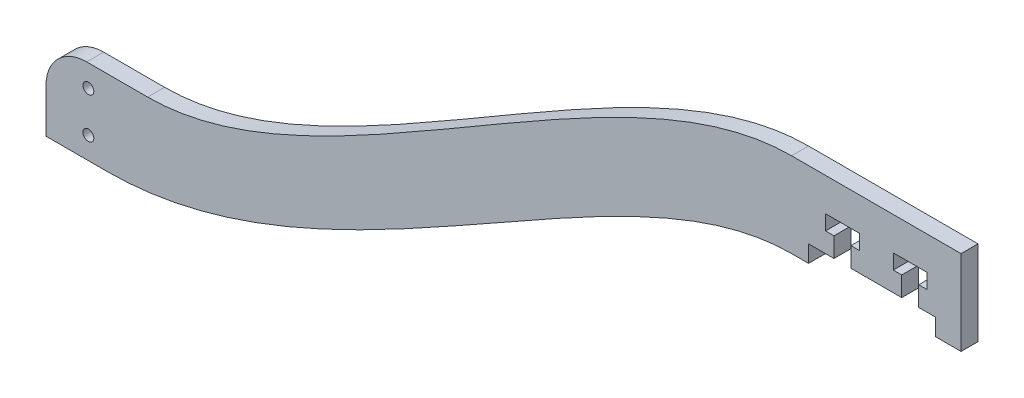
ISO-10303-21;
HEADER;
FILE_DESCRIPTION(('STEP AP214'),'2;1');
FILE_NAME('part.step','',(''),(''),'','','');
FILE_SCHEMA(('AUTOMOTIVE_DESIGN { 1 0 10303 214 1 1 1 1 }'));
ENDSEC;
DATA;
#1=APPLICATION_CONTEXT('core data for automotive mechanical design processes');
#2=APPLICATION_PROTOCOL_DEFINITION('international standard','automotive_design',2000,#1);
#3=PRODUCT_CONTEXT('',#1,'mechanical');
#4=PRODUCT('Part','Part','',(#3));
#5=PRODUCT_RELATED_PRODUCT_CATEGORY('part','',(#4));
#6=PRODUCT_DEFINITION_FORMATION('','',#4);
#7=PRODUCT_DEFINITION_CONTEXT('part definition',#1,'design');
#8=PRODUCT_DEFINITION('design','',#6,#7);
#9=PRODUCT_DEFINITION_SHAPE('','',#8);
#10=(LENGTH_UNIT() NAMED_UNIT(*) SI_UNIT(.MILLI.,.METRE.));
#11=(NAMED_UNIT(*) PLANE_ANGLE_UNIT() SI_UNIT($,.RADIAN.));
#12=(NAMED_UNIT(*) SI_UNIT($,.STERADIAN.) SOLID_ANGLE_UNIT());
#13=UNCERTAINTY_MEASURE_WITH_UNIT(LENGTH_MEASURE(1.E-05),#10,'distance_accuracy_value','');
#14=(GEOMETRIC_REPRESENTATION_CONTEXT(3) GLOBAL_UNCERTAINTY_ASSIGNED_CONTEXT((#13)) GLOBAL_UNIT_ASSIGNED_CONTEXT((#10,
#11,#12)) REPRESENTATION_CONTEXT('',''));
#15=CARTESIAN_POINT('',(0.,0.,0.));
#16=DIRECTION('',(0.,0.,1.));
#17=DIRECTION('',(1.,0.,0.));
#18=AXIS2_PLACEMENT_3D('',#15,#16,#17);
#19=CARTESIAN_POINT('',(-60.230715516146,-9.52499999999995,3.175));
#20=DIRECTION('',(0.,0.,-1.));
#21=DIRECTION('',(-1.,0.,0.));
#22=AXIS2_PLACEMENT_3D('',#19,#20,#21);
#23=PLANE('',#22);
#24=CARTESIAN_POINT('',(-131.7625,-39.0525,3.175));
#25=DIRECTION('',(0.,0.,1.));
#26=DIRECTION('',(1.,0.,0.));
#27=AXIS2_PLACEMENT_3D('',#24,#25,#26);
#28=CIRCLE('',#27,1.016);
#29=CARTESIAN_POINT('',(-130.7465,-39.0525,3.175));
#30=VERTEX_POINT('',#29);
#31=EDGE_CURVE('E260',#30,#30,#28,.T.);
#32=ORIENTED_EDGE('',*,*,#31,.F.);
#33=EDGE_LOOP('',(#32));
#34=FACE_BOUND('',#33,.T.);
#35=CARTESIAN_POINT('',(0.,15.8750000000001,3.175));
#36=CARTESIAN_POINT('',(-33.4039010932887,15.8750000000001,3.175));
#37=CARTESIAN_POINT('',(-86.9946736164341,-34.925,3.175));
#38=CARTESIAN_POINT('',(-120.65,-34.925,3.175));
#39=B_SPLINE_CURVE_WITH_KNOTS('',3,(#35,#36,#37,#38),.UNSPECIFIED.,.F.,.F.,(4,4),(0.,1.),.UNSPECIFIED.);
#40=CARTESIAN_POINT('',(0.,15.875,3.175));
#41=VERTEX_POINT('',#40);
#42=CARTESIAN_POINT('',(-120.65,-34.925,3.175));
#43=VERTEX_POINT('',#42);
#44=EDGE_CURVE('E321',#41,#43,#39,.T.);
#45=ORIENTED_EDGE('',*,*,#44,.T.);
#46=DIRECTION('',(-1.,0.,0.));
#47=VECTOR('',#46,1.);
#48=CARTESIAN_POINT('',(-120.65,-34.925,3.175));
#49=LINE('',#48,#47);
#50=CARTESIAN_POINT('',(-132.08,-34.925,3.175));
#51=VERTEX_POINT('',#50);
#52=EDGE_CURVE('E154',#43,#51,#49,.T.);
#53=ORIENTED_EDGE('',*,*,#52,.T.);
#54=CARTESIAN_POINT('',(-132.08,-42.545,3.175));
#55=DIRECTION('',(0.,0.,1.));
#56=DIRECTION('',(1.,0.,0.));
#57=AXIS2_PLACEMENT_3D('',#54,#55,#56);
#58=CIRCLE('',#57,7.61999999999999);
#59=CARTESIAN_POINT('',(-139.7,-42.545,3.175));
#60=VERTEX_POINT('',#59);
#61=EDGE_CURVE('E399',#51,#60,#58,.T.);
#62=ORIENTED_EDGE('',*,*,#61,.T.);
#63=DIRECTION('',(0.,-1.,0.));
#64=VECTOR('',#63,1.);
#65=CARTESIAN_POINT('',(-139.7,-42.545,3.175));
#66=LINE('',#65,#64);
#67=CARTESIAN_POINT('',(-139.7,-50.8,3.175));
#68=VERTEX_POINT('',#67);
#69=EDGE_CURVE('E418',#60,#68,#66,.T.);
#70=ORIENTED_EDGE('',*,*,#69,.T.);
#71=DIRECTION('',(1.,0.,0.));
#72=VECTOR('',#71,1.);
#73=CARTESIAN_POINT('',(-128.27,-50.8,3.175));
#74=LINE('',#73,#72);
#75=CARTESIAN_POINT('',(-128.27,-50.8,3.175));
#76=VERTEX_POINT('',#75);
#77=EDGE_CURVE('E415',#68,#76,#74,.T.);
#78=ORIENTED_EDGE('',*,*,#77,.T.);
#79=CARTESIAN_POINT('',(-128.27,-50.8,3.175));
#80=CARTESIAN_POINT('',(-84.7242871524058,-50.8,3.175));
#81=CARTESIAN_POINT('',(-32.99785180931,0.,3.175));
#82=CARTESIAN_POINT('',(0.,0.,3.175));
#83=B_SPLINE_CURVE_WITH_KNOTS('',3,(#79,#80,#81,#82),.UNSPECIFIED.,.F.,.F.,(4,4),(0.,1.),.UNSPECIFIED.);
#84=CARTESIAN_POINT('',(0.,0.,3.175));
#85=VERTEX_POINT('',#84);
#86=EDGE_CURVE('E417',#76,#85,#83,.T.);
#87=ORIENTED_EDGE('',*,*,#86,.T.);
#88=DIRECTION('',(1.,0.,0.));
#89=VECTOR('',#88,1.);
#90=CARTESIAN_POINT('',(0.,0.,3.175));
#91=LINE('',#90,#89);
#92=CARTESIAN_POINT('',(3.175,0.,3.175));
#93=VERTEX_POINT('',#92);
#94=EDGE_CURVE('E420',#85,#93,#91,.T.);
#95=ORIENTED_EDGE('',*,*,#94,.T.);
#96=DIRECTION('',(0.,1.,0.));
#97=VECTOR('',#96,1.);
#98=CARTESIAN_POINT('',(3.175,0.,3.175));
#99=LINE('',#98,#97);
#100=CARTESIAN_POINT('',(3.175,3.17500000000009,3.175));
#101=VERTEX_POINT('',#100);
#102=EDGE_CURVE('E862',#93,#101,#99,.T.);
#103=ORIENTED_EDGE('',*,*,#102,.T.);
#104=DIRECTION('',(1.,0.,0.));
#105=VECTOR('',#104,1.);
#106=CARTESIAN_POINT('',(3.175,3.17500000000009,3.175));
#107=LINE('',#106,#105);
#108=CARTESIAN_POINT('',(7.9375,3.17500000000009,3.175));
#109=VERTEX_POINT('',#108);
#110=EDGE_CURVE('E557',#101,#109,#107,.T.);
#111=ORIENTED_EDGE('',*,*,#110,.T.);
#112=DIRECTION('',(0.,1.,0.));
#113=VECTOR('',#112,1.);
#114=CARTESIAN_POINT('',(7.9375,3.17500000000009,3.175));
#115=LINE('',#114,#113);
#116=CARTESIAN_POINT('',(7.9375,6.85800000000011,3.175));
#117=VERTEX_POINT('',#116);
#118=EDGE_CURVE('E568',#109,#117,#115,.T.);
#119=ORIENTED_EDGE('',*,*,#118,.T.);
#120=DIRECTION('',(-1.,0.,0.));
#121=VECTOR('',#120,1.);
#122=CARTESIAN_POINT('',(7.9375,6.85800000000011,3.175));
#123=LINE('',#122,#121);
#124=CARTESIAN_POINT('',(6.35,6.85800000000011,3.175));
#125=VERTEX_POINT('',#124);
#126=EDGE_CURVE('E565',#117,#125,#123,.T.);
#127=ORIENTED_EDGE('',*,*,#126,.T.);
#128=DIRECTION('',(0.,1.,0.));
#129=VECTOR('',#128,1.);
#130=CARTESIAN_POINT('',(6.35,6.85800000000011,3.175));
#131=LINE('',#130,#129);
#132=CARTESIAN_POINT('',(6.35,9.6520000000001,3.175));
#133=VERTEX_POINT('',#132);
#134=EDGE_CURVE('E567',#125,#133,#131,.T.);
#135=ORIENTED_EDGE('',*,*,#134,.T.);
#136=DIRECTION('',(1.,0.,0.));
#137=VECTOR('',#136,1.);
#138=CARTESIAN_POINT('',(6.35,9.6520000000001,3.175));
#139=LINE('',#138,#137);
#140=CARTESIAN_POINT('',(12.7,9.6520000000001,3.175));
#141=VERTEX_POINT('',#140);
#142=EDGE_CURVE('E570',#133,#141,#139,.T.);
#143=ORIENTED_EDGE('',*,*,#142,.T.);
#144=DIRECTION('',(0.,-1.,0.));
#145=VECTOR('',#144,1.);
#146=CARTESIAN_POINT('',(12.7,9.6520000000001,3.175));
#147=LINE('',#146,#145);
#148=CARTESIAN_POINT('',(12.7,6.85800000000011,3.175));
#149=VERTEX_POINT('',#148);
#150=EDGE_CURVE('E576',#141,#149,#147,.T.);
#151=ORIENTED_EDGE('',*,*,#150,.T.);
#152=DIRECTION('',(-1.,0.,0.));
#153=VECTOR('',#152,1.);
#154=CARTESIAN_POINT('',(12.7,6.85800000000011,3.175));
#155=LINE('',#154,#153);
#156=CARTESIAN_POINT('',(11.1125,6.85800000000011,3.175));
#157=VERTEX_POINT('',#156);
#158=EDGE_CURVE('E578',#149,#157,#155,.T.);
#159=ORIENTED_EDGE('',*,*,#158,.T.);
#160=DIRECTION('',(0.,-1.,0.));
#161=VECTOR('',#160,1.);
#162=CARTESIAN_POINT('',(11.1125,6.85800000000011,3.175));
#163=LINE('',#162,#161);
#164=CARTESIAN_POINT('',(11.1125,3.17500000000009,3.175));
#165=VERTEX_POINT('',#164);
#166=EDGE_CURVE('E580',#157,#165,#163,.T.);
#167=ORIENTED_EDGE('',*,*,#166,.T.);
#168=DIRECTION('',(1.,0.,0.));
#169=VECTOR('',#168,1.);
#170=CARTESIAN_POINT('',(11.1125,3.17500000000009,3.175));
#171=LINE('',#170,#169);
#172=CARTESIAN_POINT('',(20.6375,3.17500000000009,3.175));
#173=VERTEX_POINT('',#172);
#174=EDGE_CURVE('E582',#165,#173,#171,.T.);
#175=ORIENTED_EDGE('',*,*,#174,.T.);
#176=DIRECTION('',(0.,1.,0.));
#177=VECTOR('',#176,1.);
#178=CARTESIAN_POINT('',(20.6375,3.17500000000009,3.175));
#179=LINE('',#178,#177);
#180=CARTESIAN_POINT('',(20.6375,6.85800000000011,3.175));
#181=VERTEX_POINT('',#180);
#182=EDGE_CURVE('E584',#173,#181,#179,.T.);
#183=ORIENTED_EDGE('',*,*,#182,.T.);
#184=DIRECTION('',(-1.,0.,0.));
#185=VECTOR('',#184,1.);
#186=CARTESIAN_POINT('',(20.6375,6.85800000000011,3.175));
#187=LINE('',#186,#185);
#188=CARTESIAN_POINT('',(19.05,6.85800000000011,3.175));
#189=VERTEX_POINT('',#188);
#190=EDGE_CURVE('E586',#181,#189,#187,.T.);
#191=ORIENTED_EDGE('',*,*,#190,.T.);
#192=DIRECTION('',(0.,1.,0.));
#193=VECTOR('',#192,1.);
#194=CARTESIAN_POINT('',(19.05,6.85800000000011,3.175));
#195=LINE('',#194,#193);
#196=CARTESIAN_POINT('',(19.05,9.6520000000001,3.175));
#197=VERTEX_POINT('',#196);
#198=EDGE_CURVE('E588',#189,#197,#195,.T.);
#199=ORIENTED_EDGE('',*,*,#198,.T.);
#200=DIRECTION('',(1.,0.,0.));
#201=VECTOR('',#200,1.);
#202=CARTESIAN_POINT('',(19.05,9.6520000000001,3.175));
#203=LINE('',#202,#201);
#204=CARTESIAN_POINT('',(25.4,9.6520000000001,3.175));
#205=VERTEX_POINT('',#204);
#206=EDGE_CURVE('E590',#197,#205,#203,.T.);
#207=ORIENTED_EDGE('',*,*,#206,.T.);
#208=DIRECTION('',(0.,-1.,0.));
#209=VECTOR('',#208,1.);
#210=CARTESIAN_POINT('',(25.4,9.6520000000001,3.175));
#211=LINE('',#210,#209);
#212=CARTESIAN_POINT('',(25.4,6.85800000000011,3.175));
#213=VERTEX_POINT('',#212);
#214=EDGE_CURVE('E592',#205,#213,#211,.T.);
#215=ORIENTED_EDGE('',*,*,#214,.T.);
#216=DIRECTION('',(-1.,0.,0.));
#217=VECTOR('',#216,1.);
#218=CARTESIAN_POINT('',(25.4,6.85800000000011,3.175));
#219=LINE('',#218,#217);
#220=CARTESIAN_POINT('',(23.8125,6.85800000000011,3.175));
#221=VERTEX_POINT('',#220);
#222=EDGE_CURVE('E594',#213,#221,#219,.T.);
#223=ORIENTED_EDGE('',*,*,#222,.T.);
#224=DIRECTION('',(0.,-1.,0.));
#225=VECTOR('',#224,1.);
#226=CARTESIAN_POINT('',(23.8125,6.85800000000011,3.175));
#227=LINE('',#226,#225);
#228=CARTESIAN_POINT('',(23.8125,3.17500000000009,3.175));
#229=VERTEX_POINT('',#228);
#230=EDGE_CURVE('E596',#221,#229,#227,.T.);
#231=ORIENTED_EDGE('',*,*,#230,.T.);
#232=DIRECTION('',(1.,0.,0.));
#233=VECTOR('',#232,1.);
#234=CARTESIAN_POINT('',(23.8125,3.17500000000009,3.175));
#235=LINE('',#234,#233);
#236=CARTESIAN_POINT('',(26.9875,3.17500000000009,3.175));
#237=VERTEX_POINT('',#236);
#238=EDGE_CURVE('E598',#229,#237,#235,.T.);
#239=ORIENTED_EDGE('',*,*,#238,.T.);
#240=DIRECTION('',(0.,-1.,0.));
#241=VECTOR('',#240,1.);
#242=CARTESIAN_POINT('',(26.9875,3.17500000000009,3.175));
#243=LINE('',#242,#241);
#244=CARTESIAN_POINT('',(26.9875,0.,3.175));
#245=VERTEX_POINT('',#244);
#246=EDGE_CURVE('E236',#237,#245,#243,.T.);
#247=ORIENTED_EDGE('',*,*,#246,.T.);
#248=DIRECTION('',(1.,0.,0.));
#249=VECTOR('',#248,1.);
#250=CARTESIAN_POINT('',(26.9875,0.,3.175));
#251=LINE('',#250,#249);
#252=CARTESIAN_POINT('',(31.75,0.,3.175));
#253=VERTEX_POINT('',#252);
#254=EDGE_CURVE('E230',#245,#253,#251,.T.);
#255=ORIENTED_EDGE('',*,*,#254,.T.);
#256=DIRECTION('',(0.,1.,0.));
#257=VECTOR('',#256,1.);
#258=CARTESIAN_POINT('',(31.75,0.,3.175));
#259=LINE('',#258,#257);
#260=CARTESIAN_POINT('',(31.75,15.875,3.175));
#261=VERTEX_POINT('',#260);
#262=EDGE_CURVE('E234',#253,#261,#259,.T.);
#263=ORIENTED_EDGE('',*,*,#262,.T.);
#264=DIRECTION('',(-1.,0.,0.));
#265=VECTOR('',#264,1.);
#266=CARTESIAN_POINT('',(31.75,15.875,3.175));
#267=LINE('',#266,#265);
#268=EDGE_CURVE('E48',#261,#41,#267,.T.);
#269=ORIENTED_EDGE('',*,*,#268,.T.);
#270=EDGE_LOOP('',(#45,#53,#62,#70,#78,#87,#95,#103,#111,#119,#127,#135,#143,#151,#159,#167,
#175,#183,#191,#199,#207,#215,#223,#231,#239,#247,#255,#263,#269));
#271=FACE_BOUND('',#270,.T.);
#272=CARTESIAN_POINT('',(-131.7625,-46.6725,3.175));
#273=DIRECTION('',(0.,0.,1.));
#274=DIRECTION('',(1.,0.,0.));
#275=AXIS2_PLACEMENT_3D('',#272,#273,#274);
#276=CIRCLE('',#275,1.016);
#277=CARTESIAN_POINT('',(-130.7465,-46.6725,3.175));
#278=VERTEX_POINT('',#277);
#279=EDGE_CURVE('E618',#278,#278,#276,.T.);
#280=ORIENTED_EDGE('',*,*,#279,.F.);
#281=EDGE_LOOP('',(#280));
#282=FACE_BOUND('',#281,.T.);
#283=ADVANCED_FACE('F30',(#34,#271,#282),#23,.F.);
#284=CARTESIAN_POINT('',(-60.230715516146,-9.52499999999995,0.));
#285=DIRECTION('',(0.,0.,-1.));
#286=DIRECTION('',(-1.,0.,0.));
#287=AXIS2_PLACEMENT_3D('',#284,#285,#286);
#288=PLANE('',#287);
#289=CARTESIAN_POINT('',(-131.7625,-39.0525,0.));
#290=DIRECTION('',(0.,0.,1.));
#291=DIRECTION('',(1.,0.,0.));
#292=AXIS2_PLACEMENT_3D('',#289,#290,#291);
#293=CIRCLE('',#292,1.016);
#294=CARTESIAN_POINT('',(-130.7465,-39.0525,0.));
#295=VERTEX_POINT('',#294);
#296=EDGE_CURVE('E612',#295,#295,#293,.T.);
#297=ORIENTED_EDGE('',*,*,#296,.T.);
#298=EDGE_LOOP('',(#297));
#299=FACE_BOUND('',#298,.T.);
#300=CARTESIAN_POINT('',(0.,15.8750000000001,0.));
#301=CARTESIAN_POINT('',(-33.4039010932887,15.8750000000001,0.));
#302=CARTESIAN_POINT('',(-86.9946736164341,-34.925,0.));
#303=CARTESIAN_POINT('',(-120.65,-34.925,0.));
#304=B_SPLINE_CURVE_WITH_KNOTS('',3,(#300,#301,#302,#303),.UNSPECIFIED.,.F.,.F.,(4,4),(0.,1.),.UNSPECIFIED.);
#305=CARTESIAN_POINT('',(0.,15.875,0.));
#306=VERTEX_POINT('',#305);
#307=CARTESIAN_POINT('',(-120.65,-34.925,0.));
#308=VERTEX_POINT('',#307);
#309=EDGE_CURVE('E254',#306,#308,#304,.T.);
#310=ORIENTED_EDGE('',*,*,#309,.F.);
#311=DIRECTION('',(-1.,0.,0.));
#312=VECTOR('',#311,1.);
#313=CARTESIAN_POINT('',(31.75,15.875,0.));
#314=LINE('',#313,#312);
#315=CARTESIAN_POINT('',(31.75,15.875,0.));
#316=VERTEX_POINT('',#315);
#317=EDGE_CURVE('E146',#316,#306,#314,.T.);
#318=ORIENTED_EDGE('',*,*,#317,.F.);
#319=DIRECTION('',(0.,1.,0.));
#320=VECTOR('',#319,1.);
#321=CARTESIAN_POINT('',(31.75,0.,0.));
#322=LINE('',#321,#320);
#323=CARTESIAN_POINT('',(31.75,0.,0.));
#324=VERTEX_POINT('',#323);
#325=EDGE_CURVE('E140',#324,#316,#322,.T.);
#326=ORIENTED_EDGE('',*,*,#325,.F.);
#327=DIRECTION('',(1.,0.,0.));
#328=VECTOR('',#327,1.);
#329=CARTESIAN_POINT('',(26.9875,0.,0.));
#330=LINE('',#329,#328);
#331=CARTESIAN_POINT('',(26.9875,0.,0.));
#332=VERTEX_POINT('',#331);
#333=EDGE_CURVE('E244',#332,#324,#330,.T.);
#334=ORIENTED_EDGE('',*,*,#333,.F.);
#335=DIRECTION('',(0.,-1.,0.));
#336=VECTOR('',#335,1.);
#337=CARTESIAN_POINT('',(26.9875,3.17500000000009,0.));
#338=LINE('',#337,#336);
#339=CARTESIAN_POINT('',(26.9875,3.17500000000009,0.));
#340=VERTEX_POINT('',#339);
#341=EDGE_CURVE('E316',#340,#332,#338,.T.);
#342=ORIENTED_EDGE('',*,*,#341,.F.);
#343=DIRECTION('',(1.,0.,0.));
#344=VECTOR('',#343,1.);
#345=CARTESIAN_POINT('',(23.8125,3.17500000000009,0.));
#346=LINE('',#345,#344);
#347=CARTESIAN_POINT('',(23.8125,3.17500000000009,0.));
#348=VERTEX_POINT('',#347);
#349=EDGE_CURVE('E314',#348,#340,#346,.T.);
#350=ORIENTED_EDGE('',*,*,#349,.F.);
#351=DIRECTION('',(0.,-1.,0.));
#352=VECTOR('',#351,1.);
#353=CARTESIAN_POINT('',(23.8125,6.85800000000011,0.));
#354=LINE('',#353,#352);
#355=CARTESIAN_POINT('',(23.8125,6.85800000000011,0.));
#356=VERTEX_POINT('',#355);
#357=EDGE_CURVE('E312',#356,#348,#354,.T.);
#358=ORIENTED_EDGE('',*,*,#357,.F.);
#359=DIRECTION('',(-1.,0.,0.));
#360=VECTOR('',#359,1.);
#361=CARTESIAN_POINT('',(25.4,6.85800000000011,0.));
#362=LINE('',#361,#360);
#363=CARTESIAN_POINT('',(25.4,6.85800000000011,0.));
#364=VERTEX_POINT('',#363);
#365=EDGE_CURVE('E310',#364,#356,#362,.T.);
#366=ORIENTED_EDGE('',*,*,#365,.F.);
#367=DIRECTION('',(0.,-1.,0.));
#368=VECTOR('',#367,1.);
#369=CARTESIAN_POINT('',(25.4,9.6520000000001,0.));
#370=LINE('',#369,#368);
#371=CARTESIAN_POINT('',(25.4,9.6520000000001,0.));
#372=VERTEX_POINT('',#371);
#373=EDGE_CURVE('E308',#372,#364,#370,.T.);
#374=ORIENTED_EDGE('',*,*,#373,.F.);
#375=DIRECTION('',(1.,0.,0.));
#376=VECTOR('',#375,1.);
#377=CARTESIAN_POINT('',(19.05,9.6520000000001,0.));
#378=LINE('',#377,#376);
#379=CARTESIAN_POINT('',(19.05,9.6520000000001,0.));
#380=VERTEX_POINT('',#379);
#381=EDGE_CURVE('E306',#380,#372,#378,.T.);
#382=ORIENTED_EDGE('',*,*,#381,.F.);
#383=DIRECTION('',(0.,1.,0.));
#384=VECTOR('',#383,1.);
#385=CARTESIAN_POINT('',(19.05,6.85800000000011,0.));
#386=LINE('',#385,#384);
#387=CARTESIAN_POINT('',(19.05,6.85800000000011,0.));
#388=VERTEX_POINT('',#387);
#389=EDGE_CURVE('E304',#388,#380,#386,.T.);
#390=ORIENTED_EDGE('',*,*,#389,.F.);
#391=DIRECTION('',(-1.,0.,0.));
#392=VECTOR('',#391,1.);
#393=CARTESIAN_POINT('',(20.6375,6.85800000000011,0.));
#394=LINE('',#393,#392);
#395=CARTESIAN_POINT('',(20.6375,6.85800000000011,0.));
#396=VERTEX_POINT('',#395);
#397=EDGE_CURVE('E302',#396,#388,#394,.T.);
#398=ORIENTED_EDGE('',*,*,#397,.F.);
#399=DIRECTION('',(0.,1.,0.));
#400=VECTOR('',#399,1.);
#401=CARTESIAN_POINT('',(20.6375,3.17500000000009,0.));
#402=LINE('',#401,#400);
#403=CARTESIAN_POINT('',(20.6375,3.17500000000009,0.));
#404=VERTEX_POINT('',#403);
#405=EDGE_CURVE('E300',#404,#396,#402,.T.);
#406=ORIENTED_EDGE('',*,*,#405,.F.);
#407=DIRECTION('',(1.,0.,0.));
#408=VECTOR('',#407,1.);
#409=CARTESIAN_POINT('',(11.1125,3.17500000000009,0.));
#410=LINE('',#409,#408);
#411=CARTESIAN_POINT('',(11.1125,3.17500000000009,0.));
#412=VERTEX_POINT('',#411);
#413=EDGE_CURVE('E298',#412,#404,#410,.T.);
#414=ORIENTED_EDGE('',*,*,#413,.F.);
#415=DIRECTION('',(0.,-1.,0.));
#416=VECTOR('',#415,1.);
#417=CARTESIAN_POINT('',(11.1125,6.85800000000011,0.));
#418=LINE('',#417,#416);
#419=CARTESIAN_POINT('',(11.1125,6.85800000000011,0.));
#420=VERTEX_POINT('',#419);
#421=EDGE_CURVE('E296',#420,#412,#418,.T.);
#422=ORIENTED_EDGE('',*,*,#421,.F.);
#423=DIRECTION('',(-1.,0.,0.));
#424=VECTOR('',#423,1.);
#425=CARTESIAN_POINT('',(12.7,6.85800000000011,0.));
#426=LINE('',#425,#424);
#427=CARTESIAN_POINT('',(12.7,6.85800000000011,0.));
#428=VERTEX_POINT('',#427);
#429=EDGE_CURVE('E294',#428,#420,#426,.T.);
#430=ORIENTED_EDGE('',*,*,#429,.F.);
#431=DIRECTION('',(0.,-1.,0.));
#432=VECTOR('',#431,1.);
#433=CARTESIAN_POINT('',(12.7,9.6520000000001,0.));
#434=LINE('',#433,#432);
#435=CARTESIAN_POINT('',(12.7,9.6520000000001,0.));
#436=VERTEX_POINT('',#435);
#437=EDGE_CURVE('E292',#436,#428,#434,.T.);
#438=ORIENTED_EDGE('',*,*,#437,.F.);
#439=DIRECTION('',(1.,0.,0.));
#440=VECTOR('',#439,1.);
#441=CARTESIAN_POINT('',(6.35,9.6520000000001,0.));
#442=LINE('',#441,#440);
#443=CARTESIAN_POINT('',(6.35,9.6520000000001,0.));
#444=VERTEX_POINT('',#443);
#445=EDGE_CURVE('E290',#444,#436,#442,.T.);
#446=ORIENTED_EDGE('',*,*,#445,.F.);
#447=DIRECTION('',(0.,1.,0.));
#448=VECTOR('',#447,1.);
#449=CARTESIAN_POINT('',(6.35,6.85800000000011,0.));
#450=LINE('',#449,#448);
#451=CARTESIAN_POINT('',(6.35,6.85800000000011,0.));
#452=VERTEX_POINT('',#451);
#453=EDGE_CURVE('E288',#452,#444,#450,.T.);
#454=ORIENTED_EDGE('',*,*,#453,.F.);
#455=DIRECTION('',(-1.,0.,0.));
#456=VECTOR('',#455,1.);
#457=CARTESIAN_POINT('',(7.9375,6.85800000000011,0.));
#458=LINE('',#457,#456);
#459=CARTESIAN_POINT('',(7.9375,6.85800000000011,0.));
#460=VERTEX_POINT('',#459);
#461=EDGE_CURVE('E286',#460,#452,#458,.T.);
#462=ORIENTED_EDGE('',*,*,#461,.F.);
#463=DIRECTION('',(0.,1.,0.));
#464=VECTOR('',#463,1.);
#465=CARTESIAN_POINT('',(7.9375,3.17500000000009,0.));
#466=LINE('',#465,#464);
#467=CARTESIAN_POINT('',(7.9375,3.17500000000009,0.));
#468=VERTEX_POINT('',#467);
#469=EDGE_CURVE('E284',#468,#460,#466,.T.);
#470=ORIENTED_EDGE('',*,*,#469,.F.);
#471=DIRECTION('',(1.,0.,0.));
#472=VECTOR('',#471,1.);
#473=CARTESIAN_POINT('',(3.175,3.17500000000009,0.));
#474=LINE('',#473,#472);
#475=CARTESIAN_POINT('',(3.175,3.17500000000009,0.));
#476=VERTEX_POINT('',#475);
#477=EDGE_CURVE('E282',#476,#468,#474,.T.);
#478=ORIENTED_EDGE('',*,*,#477,.F.);
#479=DIRECTION('',(0.,1.,0.));
#480=VECTOR('',#479,1.);
#481=CARTESIAN_POINT('',(3.175,0.,0.));
#482=LINE('',#481,#480);
#483=CARTESIAN_POINT('',(3.175,0.,0.));
#484=VERTEX_POINT('',#483);
#485=EDGE_CURVE('E280',#484,#476,#482,.T.);
#486=ORIENTED_EDGE('',*,*,#485,.F.);
#487=DIRECTION('',(1.,0.,0.));
#488=VECTOR('',#487,1.);
#489=CARTESIAN_POINT('',(0.,0.,0.));
#490=LINE('',#489,#488);
#491=CARTESIAN_POINT('',(0.,0.,0.));
#492=VERTEX_POINT('',#491);
#493=EDGE_CURVE('E275',#492,#484,#490,.T.);
#494=ORIENTED_EDGE('',*,*,#493,.F.);
#495=CARTESIAN_POINT('',(-128.27,-50.8,0.));
#496=CARTESIAN_POINT('',(-84.7242871524058,-50.8,0.));
#497=CARTESIAN_POINT('',(-32.99785180931,0.,0.));
#498=CARTESIAN_POINT('',(0.,0.,0.));
#499=B_SPLINE_CURVE_WITH_KNOTS('',3,(#495,#496,#497,#498),.UNSPECIFIED.,.F.,.F.,(4,4),(0.,1.),.UNSPECIFIED.);
#500=CARTESIAN_POINT('',(-128.27,-50.8,0.));
#501=VERTEX_POINT('',#500);
#502=EDGE_CURVE('E271',#501,#492,#499,.T.);
#503=ORIENTED_EDGE('',*,*,#502,.F.);
#504=DIRECTION('',(1.,0.,0.));
#505=VECTOR('',#504,1.);
#506=CARTESIAN_POINT('',(-128.27,-50.8,0.));
#507=LINE('',#506,#505);
#508=CARTESIAN_POINT('',(-139.7,-50.8,0.));
#509=VERTEX_POINT('',#508);
#510=EDGE_CURVE('E269',#509,#501,#507,.T.);
#511=ORIENTED_EDGE('',*,*,#510,.F.);
#512=DIRECTION('',(0.,-1.,0.));
#513=VECTOR('',#512,1.);
#514=CARTESIAN_POINT('',(-139.7,-42.545,0.));
#515=LINE('',#514,#513);
#516=CARTESIAN_POINT('',(-139.7,-42.545,0.));
#517=VERTEX_POINT('',#516);
#518=EDGE_CURVE('E267',#517,#509,#515,.T.);
#519=ORIENTED_EDGE('',*,*,#518,.F.);
#520=CARTESIAN_POINT('',(-132.08,-42.545,0.));
#521=DIRECTION('',(0.,0.,1.));
#522=DIRECTION('',(1.,0.,0.));
#523=AXIS2_PLACEMENT_3D('',#520,#521,#522);
#524=CIRCLE('',#523,7.61999999999999);
#525=CARTESIAN_POINT('',(-132.08,-34.925,0.));
#526=VERTEX_POINT('',#525);
#527=EDGE_CURVE('E265',#526,#517,#524,.T.);
#528=ORIENTED_EDGE('',*,*,#527,.F.);
#529=DIRECTION('',(-1.,0.,0.));
#530=VECTOR('',#529,1.);
#531=CARTESIAN_POINT('',(-120.65,-34.925,0.));
#532=LINE('',#531,#530);
#533=EDGE_CURVE('E259',#308,#526,#532,.T.);
#534=ORIENTED_EDGE('',*,*,#533,.F.);
#535=EDGE_LOOP('',(#310,#318,#326,#334,#342,#350,#358,#366,#374,#382,#390,#398,#406,#414,#422,
#430,#438,#446,#454,#462,#470,#478,#486,#494,#503,#511,#519,#528,#534));
#536=FACE_BOUND('',#535,.T.);
#537=CARTESIAN_POINT('',(-131.7625,-46.6725,0.));
#538=DIRECTION('',(0.,0.,1.));
#539=DIRECTION('',(1.,0.,0.));
#540=AXIS2_PLACEMENT_3D('',#537,#538,#539);
#541=CIRCLE('',#540,1.016);
#542=CARTESIAN_POINT('',(-130.7465,-46.6725,0.));
#543=VERTEX_POINT('',#542);
#544=EDGE_CURVE('E621',#543,#543,#541,.T.);
#545=ORIENTED_EDGE('',*,*,#544,.T.);
#546=EDGE_LOOP('',(#545));
#547=FACE_BOUND('',#546,.T.);
#548=ADVANCED_FACE('F403',(#299,#536,#547),#288,.T.);
#549=DIRECTION('',(0.,0.,-1.));
#550=VECTOR('',#549,1.);
#551=SURFACE_OF_LINEAR_EXTRUSION('',#39,#550);
#552=ORIENTED_EDGE('',*,*,#309,.T.);
#553=DIRECTION('',(0.,0.,-1.));
#554=VECTOR('',#553,1.);
#555=CARTESIAN_POINT('',(-120.65,-34.925,3.175));
#556=LINE('',#555,#554);
#557=EDGE_CURVE('E11',#43,#308,#556,.T.);
#558=ORIENTED_EDGE('',*,*,#557,.F.);
#559=ORIENTED_EDGE('',*,*,#44,.F.);
#560=DIRECTION('',(0.,0.,-1.));
#561=VECTOR('',#560,1.);
#562=CARTESIAN_POINT('',(0.,15.875,3.175));
#563=LINE('',#562,#561);
#564=EDGE_CURVE('E250',#41,#306,#563,.T.);
#565=ORIENTED_EDGE('',*,*,#564,.T.);
#566=EDGE_LOOP('',(#552,#558,#559,#565));
#567=FACE_BOUND('',#566,.T.);
#568=ADVANCED_FACE('F32',(#567),#551,.F.);
#569=CARTESIAN_POINT('',(-120.65,-34.925,3.175));
#570=DIRECTION('',(0.,-1.,0.));
#571=DIRECTION('',(1.,0.,0.));
#572=AXIS2_PLACEMENT_3D('',#569,#570,#571);
#573=PLANE('',#572);
#574=ORIENTED_EDGE('',*,*,#533,.T.);
#575=DIRECTION('',(0.,0.,-1.));
#576=VECTOR('',#575,1.);
#577=CARTESIAN_POINT('',(-132.08,-34.925,3.175));
#578=LINE('',#577,#576);
#579=EDGE_CURVE('E40',#51,#526,#578,.T.);
#580=ORIENTED_EDGE('',*,*,#579,.F.);
#581=ORIENTED_EDGE('',*,*,#52,.F.);
#582=ORIENTED_EDGE('',*,*,#557,.T.);
#583=EDGE_LOOP('',(#574,#580,#581,#582));
#584=FACE_BOUND('',#583,.T.);
#585=ADVANCED_FACE('F445',(#584),#573,.F.);
#586=CARTESIAN_POINT('',(-132.08,-42.545,3.175));
#587=DIRECTION('',(0.,0.,-1.));
#588=DIRECTION('',(-1.,0.,0.));
#589=AXIS2_PLACEMENT_3D('',#586,#587,#588);
#590=CYLINDRICAL_SURFACE('',#589,7.61999999999999);
#591=ORIENTED_EDGE('',*,*,#527,.T.);
#592=DIRECTION('',(0.,0.,-1.));
#593=VECTOR('',#592,1.);
#594=CARTESIAN_POINT('',(-139.7,-42.545,3.175));
#595=LINE('',#594,#593);
#596=EDGE_CURVE('E391',#60,#517,#595,.T.);
#597=ORIENTED_EDGE('',*,*,#596,.F.);
#598=ORIENTED_EDGE('',*,*,#61,.F.);
#599=ORIENTED_EDGE('',*,*,#579,.T.);
#600=EDGE_LOOP('',(#591,#597,#598,#599));
#601=FACE_BOUND('',#600,.T.);
#602=ADVANCED_FACE('F397',(#601),#590,.T.);
#603=CARTESIAN_POINT('',(-139.7,-42.545,3.175));
#604=DIRECTION('',(1.,0.,0.));
#605=DIRECTION('',(0.,0.,-1.));
#606=AXIS2_PLACEMENT_3D('',#603,#604,#605);
#607=PLANE('',#606);
#608=ORIENTED_EDGE('',*,*,#518,.T.);
#609=DIRECTION('',(0.,0.,-1.));
#610=VECTOR('',#609,1.);
#611=CARTESIAN_POINT('',(-139.7,-50.8,3.175));
#612=LINE('',#611,#610);
#613=EDGE_CURVE('E388',#68,#509,#612,.T.);
#614=ORIENTED_EDGE('',*,*,#613,.F.);
#615=ORIENTED_EDGE('',*,*,#69,.F.);
#616=ORIENTED_EDGE('',*,*,#596,.T.);
#617=EDGE_LOOP('',(#608,#614,#615,#616));
#618=FACE_BOUND('',#617,.T.);
#619=ADVANCED_FACE('F409',(#618),#607,.F.);
#620=CARTESIAN_POINT('',(-128.27,-50.8,3.175));
#621=DIRECTION('',(0.,1.,0.));
#622=DIRECTION('',(-1.,0.,0.));
#623=AXIS2_PLACEMENT_3D('',#620,#621,#622);
#624=PLANE('',#623);
#625=ORIENTED_EDGE('',*,*,#510,.T.);
#626=DIRECTION('',(0.,0.,-1.));
#627=VECTOR('',#626,1.);
#628=CARTESIAN_POINT('',(-128.27,-50.8,3.175));
#629=LINE('',#628,#627);
#630=EDGE_CURVE('E385',#76,#501,#629,.T.);
#631=ORIENTED_EDGE('',*,*,#630,.F.);
#632=ORIENTED_EDGE('',*,*,#77,.F.);
#633=ORIENTED_EDGE('',*,*,#613,.T.);
#634=EDGE_LOOP('',(#625,#631,#632,#633));
#635=FACE_BOUND('',#634,.T.);
#636=ADVANCED_FACE('F413',(#635),#624,.F.);
#637=DIRECTION('',(0.,0.,-1.));
#638=VECTOR('',#637,1.);
#639=SURFACE_OF_LINEAR_EXTRUSION('',#83,#638);
#640=ORIENTED_EDGE('',*,*,#502,.T.);
#641=DIRECTION('',(0.,0.,-1.));
#642=VECTOR('',#641,1.);
#643=CARTESIAN_POINT('',(0.,0.,3.175));
#644=LINE('',#643,#642);
#645=EDGE_CURVE('E382',#85,#492,#644,.T.);
#646=ORIENTED_EDGE('',*,*,#645,.F.);
#647=ORIENTED_EDGE('',*,*,#86,.F.);
#648=ORIENTED_EDGE('',*,*,#630,.T.);
#649=EDGE_LOOP('',(#640,#646,#647,#648));
#650=FACE_BOUND('',#649,.T.);
#651=ADVANCED_FACE('F433',(#650),#639,.F.);
#652=CARTESIAN_POINT('',(0.,0.,3.175));
#653=DIRECTION('',(0.,1.,0.));
#654=DIRECTION('',(0.,0.,1.));
#655=AXIS2_PLACEMENT_3D('',#652,#653,#654);
#656=PLANE('',#655);
#657=ORIENTED_EDGE('',*,*,#493,.T.);
#658=DIRECTION('',(0.,0.,-1.));
#659=VECTOR('',#658,1.);
#660=CARTESIAN_POINT('',(3.175,0.,3.175));
#661=LINE('',#660,#659);
#662=EDGE_CURVE('E379',#93,#484,#661,.T.);
#663=ORIENTED_EDGE('',*,*,#662,.F.);
#664=ORIENTED_EDGE('',*,*,#94,.F.);
#665=ORIENTED_EDGE('',*,*,#645,.T.);
#666=EDGE_LOOP('',(#657,#663,#664,#665));
#667=FACE_BOUND('',#666,.T.);
#668=ADVANCED_FACE('F437',(#667),#656,.F.);
#669=CARTESIAN_POINT('',(3.175,0.,3.175));
#670=DIRECTION('',(-1.,0.,0.));
#671=DIRECTION('',(0.,0.,1.));
#672=AXIS2_PLACEMENT_3D('',#669,#670,#671);
#673=PLANE('',#672);
#674=ORIENTED_EDGE('',*,*,#485,.T.);
#675=DIRECTION('',(0.,0.,-1.));
#676=VECTOR('',#675,1.);
#677=CARTESIAN_POINT('',(3.175,3.17500000000009,3.175));
#678=LINE('',#677,#676);
#679=EDGE_CURVE('E376',#101,#476,#678,.T.);
#680=ORIENTED_EDGE('',*,*,#679,.F.);
#681=ORIENTED_EDGE('',*,*,#102,.F.);
#682=ORIENTED_EDGE('',*,*,#662,.T.);
#683=EDGE_LOOP('',(#674,#680,#681,#682));
#684=FACE_BOUND('',#683,.T.);
#685=ADVANCED_FACE('F541',(#684),#673,.F.);
#686=CARTESIAN_POINT('',(3.175,3.17500000000009,3.175));
#687=DIRECTION('',(0.,1.,0.));
#688=DIRECTION('',(0.,0.,1.));
#689=AXIS2_PLACEMENT_3D('',#686,#687,#688);
#690=PLANE('',#689);
#691=ORIENTED_EDGE('',*,*,#477,.T.);
#692=DIRECTION('',(0.,0.,-1.));
#693=VECTOR('',#692,1.);
#694=CARTESIAN_POINT('',(7.9375,3.17500000000009,3.175));
#695=LINE('',#694,#693);
#696=EDGE_CURVE('E373',#109,#468,#695,.T.);
#697=ORIENTED_EDGE('',*,*,#696,.F.);
#698=ORIENTED_EDGE('',*,*,#110,.F.);
#699=ORIENTED_EDGE('',*,*,#679,.T.);
#700=EDGE_LOOP('',(#691,#697,#698,#699));
#701=FACE_BOUND('',#700,.T.);
#702=ADVANCED_FACE('F538',(#701),#690,.F.);
#703=CARTESIAN_POINT('',(7.9375,3.17500000000009,3.175));
#704=DIRECTION('',(-1.,0.,0.));
#705=DIRECTION('',(0.,0.,1.));
#706=AXIS2_PLACEMENT_3D('',#703,#704,#705);
#707=PLANE('',#706);
#708=ORIENTED_EDGE('',*,*,#469,.T.);
#709=DIRECTION('',(0.,0.,-1.));
#710=VECTOR('',#709,1.);
#711=CARTESIAN_POINT('',(7.9375,6.85800000000011,3.175));
#712=LINE('',#711,#710);
#713=EDGE_CURVE('E370',#117,#460,#712,.T.);
#714=ORIENTED_EDGE('',*,*,#713,.F.);
#715=ORIENTED_EDGE('',*,*,#118,.F.);
#716=ORIENTED_EDGE('',*,*,#696,.T.);
#717=EDGE_LOOP('',(#708,#714,#715,#716));
#718=FACE_BOUND('',#717,.T.);
#719=ADVANCED_FACE('F534',(#718),#707,.F.);
#720=CARTESIAN_POINT('',(7.9375,6.85800000000011,3.175));
#721=DIRECTION('',(0.,-1.,0.));
#722=DIRECTION('',(0.,0.,-1.));
#723=AXIS2_PLACEMENT_3D('',#720,#721,#722);
#724=PLANE('',#723);
#725=ORIENTED_EDGE('',*,*,#461,.T.);
#726=DIRECTION('',(0.,0.,-1.));
#727=VECTOR('',#726,1.);
#728=CARTESIAN_POINT('',(6.35,6.85800000000011,3.175));
#729=LINE('',#728,#727);
#730=EDGE_CURVE('E367',#125,#452,#729,.T.);
#731=ORIENTED_EDGE('',*,*,#730,.F.);
#732=ORIENTED_EDGE('',*,*,#126,.F.);
#733=ORIENTED_EDGE('',*,*,#713,.T.);
#734=EDGE_LOOP('',(#725,#731,#732,#733));
#735=FACE_BOUND('',#734,.T.);
#736=ADVANCED_FACE('F530',(#735),#724,.F.);
#737=CARTESIAN_POINT('',(6.35,6.85800000000011,3.175));
#738=DIRECTION('',(-1.,0.,0.));
#739=DIRECTION('',(0.,0.,1.));
#740=AXIS2_PLACEMENT_3D('',#737,#738,#739);
#741=PLANE('',#740);
#742=ORIENTED_EDGE('',*,*,#453,.T.);
#743=DIRECTION('',(0.,0.,-1.));
#744=VECTOR('',#743,1.);
#745=CARTESIAN_POINT('',(6.35,9.6520000000001,3.175));
#746=LINE('',#745,#744);
#747=EDGE_CURVE('E364',#133,#444,#746,.T.);
#748=ORIENTED_EDGE('',*,*,#747,.F.);
#749=ORIENTED_EDGE('',*,*,#134,.F.);
#750=ORIENTED_EDGE('',*,*,#730,.T.);
#751=EDGE_LOOP('',(#742,#748,#749,#750));
#752=FACE_BOUND('',#751,.T.);
#753=ADVANCED_FACE('F526',(#752),#741,.F.);
#754=CARTESIAN_POINT('',(6.35,9.6520000000001,3.175));
#755=DIRECTION('',(0.,1.,0.));
#756=DIRECTION('',(0.,0.,1.));
#757=AXIS2_PLACEMENT_3D('',#754,#755,#756);
#758=PLANE('',#757);
#759=ORIENTED_EDGE('',*,*,#445,.T.);
#760=DIRECTION('',(0.,0.,-1.));
#761=VECTOR('',#760,1.);
#762=CARTESIAN_POINT('',(12.7,9.6520000000001,3.175));
#763=LINE('',#762,#761);
#764=EDGE_CURVE('E361',#141,#436,#763,.T.);
#765=ORIENTED_EDGE('',*,*,#764,.F.);
#766=ORIENTED_EDGE('',*,*,#142,.F.);
#767=ORIENTED_EDGE('',*,*,#747,.T.);
#768=EDGE_LOOP('',(#759,#765,#766,#767));
#769=FACE_BOUND('',#768,.T.);
#770=ADVANCED_FACE('F522',(#769),#758,.F.);
#771=CARTESIAN_POINT('',(12.7,9.6520000000001,3.175));
#772=DIRECTION('',(1.,0.,0.));
#773=DIRECTION('',(0.,0.,-1.));
#774=AXIS2_PLACEMENT_3D('',#771,#772,#773);
#775=PLANE('',#774);
#776=ORIENTED_EDGE('',*,*,#437,.T.);
#777=DIRECTION('',(0.,0.,-1.));
#778=VECTOR('',#777,1.);
#779=CARTESIAN_POINT('',(12.7,6.85800000000011,3.175));
#780=LINE('',#779,#778);
#781=EDGE_CURVE('E358',#149,#428,#780,.T.);
#782=ORIENTED_EDGE('',*,*,#781,.F.);
#783=ORIENTED_EDGE('',*,*,#150,.F.);
#784=ORIENTED_EDGE('',*,*,#764,.T.);
#785=EDGE_LOOP('',(#776,#782,#783,#784));
#786=FACE_BOUND('',#785,.T.);
#787=ADVANCED_FACE('F518',(#786),#775,.F.);
#788=CARTESIAN_POINT('',(12.7,6.85800000000011,3.175));
#789=DIRECTION('',(0.,-1.,0.));
#790=DIRECTION('',(0.,0.,-1.));
#791=AXIS2_PLACEMENT_3D('',#788,#789,#790);
#792=PLANE('',#791);
#793=ORIENTED_EDGE('',*,*,#429,.T.);
#794=DIRECTION('',(0.,0.,-1.));
#795=VECTOR('',#794,1.);
#796=CARTESIAN_POINT('',(11.1125,6.85800000000011,3.175));
#797=LINE('',#796,#795);
#798=EDGE_CURVE('E355',#157,#420,#797,.T.);
#799=ORIENTED_EDGE('',*,*,#798,.F.);
#800=ORIENTED_EDGE('',*,*,#158,.F.);
#801=ORIENTED_EDGE('',*,*,#781,.T.);
#802=EDGE_LOOP('',(#793,#799,#800,#801));
#803=FACE_BOUND('',#802,.T.);
#804=ADVANCED_FACE('F514',(#803),#792,.F.);
#805=CARTESIAN_POINT('',(11.1125,6.85800000000011,3.175));
#806=DIRECTION('',(1.,0.,0.));
#807=DIRECTION('',(0.,0.,-1.));
#808=AXIS2_PLACEMENT_3D('',#805,#806,#807);
#809=PLANE('',#808);
#810=ORIENTED_EDGE('',*,*,#421,.T.);
#811=DIRECTION('',(0.,0.,-1.));
#812=VECTOR('',#811,1.);
#813=CARTESIAN_POINT('',(11.1125,3.17500000000009,3.175));
#814=LINE('',#813,#812);
#815=EDGE_CURVE('E352',#165,#412,#814,.T.);
#816=ORIENTED_EDGE('',*,*,#815,.F.);
#817=ORIENTED_EDGE('',*,*,#166,.F.);
#818=ORIENTED_EDGE('',*,*,#798,.T.);
#819=EDGE_LOOP('',(#810,#816,#817,#818));
#820=FACE_BOUND('',#819,.T.);
#821=ADVANCED_FACE('F510',(#820),#809,.F.);
#822=CARTESIAN_POINT('',(11.1125,3.17500000000009,3.175));
#823=DIRECTION('',(0.,1.,0.));
#824=DIRECTION('',(0.,0.,1.));
#825=AXIS2_PLACEMENT_3D('',#822,#823,#824);
#826=PLANE('',#825);
#827=ORIENTED_EDGE('',*,*,#413,.T.);
#828=DIRECTION('',(0.,0.,-1.));
#829=VECTOR('',#828,1.);
#830=CARTESIAN_POINT('',(20.6375,3.17500000000009,3.175));
#831=LINE('',#830,#829);
#832=EDGE_CURVE('E349',#173,#404,#831,.T.);
#833=ORIENTED_EDGE('',*,*,#832,.F.);
#834=ORIENTED_EDGE('',*,*,#174,.F.);
#835=ORIENTED_EDGE('',*,*,#815,.T.);
#836=EDGE_LOOP('',(#827,#833,#834,#835));
#837=FACE_BOUND('',#836,.T.);
#838=ADVANCED_FACE('F506',(#837),#826,.F.);
#839=CARTESIAN_POINT('',(20.6375,3.17500000000009,3.175));
#840=DIRECTION('',(-1.,0.,0.));
#841=DIRECTION('',(0.,0.,1.));
#842=AXIS2_PLACEMENT_3D('',#839,#840,#841);
#843=PLANE('',#842);
#844=ORIENTED_EDGE('',*,*,#405,.T.);
#845=DIRECTION('',(0.,0.,-1.));
#846=VECTOR('',#845,1.);
#847=CARTESIAN_POINT('',(20.6375,6.85800000000011,3.175));
#848=LINE('',#847,#846);
#849=EDGE_CURVE('E346',#181,#396,#848,.T.);
#850=ORIENTED_EDGE('',*,*,#849,.F.);
#851=ORIENTED_EDGE('',*,*,#182,.F.);
#852=ORIENTED_EDGE('',*,*,#832,.T.);
#853=EDGE_LOOP('',(#844,#850,#851,#852));
#854=FACE_BOUND('',#853,.T.);
#855=ADVANCED_FACE('F502',(#854),#843,.F.);
#856=CARTESIAN_POINT('',(20.6375,6.85800000000011,3.175));
#857=DIRECTION('',(0.,-1.,0.));
#858=DIRECTION('',(0.,0.,-1.));
#859=AXIS2_PLACEMENT_3D('',#856,#857,#858);
#860=PLANE('',#859);
#861=ORIENTED_EDGE('',*,*,#397,.T.);
#862=DIRECTION('',(0.,0.,-1.));
#863=VECTOR('',#862,1.);
#864=CARTESIAN_POINT('',(19.05,6.85800000000011,3.175));
#865=LINE('',#864,#863);
#866=EDGE_CURVE('E343',#189,#388,#865,.T.);
#867=ORIENTED_EDGE('',*,*,#866,.F.);
#868=ORIENTED_EDGE('',*,*,#190,.F.);
#869=ORIENTED_EDGE('',*,*,#849,.T.);
#870=EDGE_LOOP('',(#861,#867,#868,#869));
#871=FACE_BOUND('',#870,.T.);
#872=ADVANCED_FACE('F498',(#871),#860,.F.);
#873=CARTESIAN_POINT('',(19.05,6.85800000000011,3.175));
#874=DIRECTION('',(-1.,0.,0.));
#875=DIRECTION('',(0.,0.,1.));
#876=AXIS2_PLACEMENT_3D('',#873,#874,#875);
#877=PLANE('',#876);
#878=ORIENTED_EDGE('',*,*,#389,.T.);
#879=DIRECTION('',(0.,0.,-1.));
#880=VECTOR('',#879,1.);
#881=CARTESIAN_POINT('',(19.05,9.6520000000001,3.175));
#882=LINE('',#881,#880);
#883=EDGE_CURVE('E340',#197,#380,#882,.T.);
#884=ORIENTED_EDGE('',*,*,#883,.F.);
#885=ORIENTED_EDGE('',*,*,#198,.F.);
#886=ORIENTED_EDGE('',*,*,#866,.T.);
#887=EDGE_LOOP('',(#878,#884,#885,#886));
#888=FACE_BOUND('',#887,.T.);
#889=ADVANCED_FACE('F494',(#888),#877,.F.);
#890=CARTESIAN_POINT('',(19.05,9.6520000000001,3.175));
#891=DIRECTION('',(0.,1.,0.));
#892=DIRECTION('',(0.,0.,1.));
#893=AXIS2_PLACEMENT_3D('',#890,#891,#892);
#894=PLANE('',#893);
#895=ORIENTED_EDGE('',*,*,#381,.T.);
#896=DIRECTION('',(0.,0.,-1.));
#897=VECTOR('',#896,1.);
#898=CARTESIAN_POINT('',(25.4,9.6520000000001,3.175));
#899=LINE('',#898,#897);
#900=EDGE_CURVE('E337',#205,#372,#899,.T.);
#901=ORIENTED_EDGE('',*,*,#900,.F.);
#902=ORIENTED_EDGE('',*,*,#206,.F.);
#903=ORIENTED_EDGE('',*,*,#883,.T.);
#904=EDGE_LOOP('',(#895,#901,#902,#903));
#905=FACE_BOUND('',#904,.T.);
#906=ADVANCED_FACE('F490',(#905),#894,.F.);
#907=CARTESIAN_POINT('',(25.4,9.6520000000001,3.175));
#908=DIRECTION('',(1.,0.,0.));
#909=DIRECTION('',(0.,0.,-1.));
#910=AXIS2_PLACEMENT_3D('',#907,#908,#909);
#911=PLANE('',#910);
#912=ORIENTED_EDGE('',*,*,#373,.T.);
#913=DIRECTION('',(0.,0.,-1.));
#914=VECTOR('',#913,1.);
#915=CARTESIAN_POINT('',(25.4,6.85800000000011,3.175));
#916=LINE('',#915,#914);
#917=EDGE_CURVE('E334',#213,#364,#916,.T.);
#918=ORIENTED_EDGE('',*,*,#917,.F.);
#919=ORIENTED_EDGE('',*,*,#214,.F.);
#920=ORIENTED_EDGE('',*,*,#900,.T.);
#921=EDGE_LOOP('',(#912,#918,#919,#920));
#922=FACE_BOUND('',#921,.T.);
#923=ADVANCED_FACE('F486',(#922),#911,.F.);
#924=CARTESIAN_POINT('',(25.4,6.85800000000011,3.175));
#925=DIRECTION('',(0.,-1.,0.));
#926=DIRECTION('',(0.,0.,-1.));
#927=AXIS2_PLACEMENT_3D('',#924,#925,#926);
#928=PLANE('',#927);
#929=ORIENTED_EDGE('',*,*,#365,.T.);
#930=DIRECTION('',(0.,0.,-1.));
#931=VECTOR('',#930,1.);
#932=CARTESIAN_POINT('',(23.8125,6.85800000000011,3.175));
#933=LINE('',#932,#931);
#934=EDGE_CURVE('E331',#221,#356,#933,.T.);
#935=ORIENTED_EDGE('',*,*,#934,.F.);
#936=ORIENTED_EDGE('',*,*,#222,.F.);
#937=ORIENTED_EDGE('',*,*,#917,.T.);
#938=EDGE_LOOP('',(#929,#935,#936,#937));
#939=FACE_BOUND('',#938,.T.);
#940=ADVANCED_FACE('F482',(#939),#928,.F.);
#941=CARTESIAN_POINT('',(23.8125,6.85800000000011,3.175));
#942=DIRECTION('',(1.,0.,0.));
#943=DIRECTION('',(0.,0.,-1.));
#944=AXIS2_PLACEMENT_3D('',#941,#942,#943);
#945=PLANE('',#944);
#946=ORIENTED_EDGE('',*,*,#357,.T.);
#947=DIRECTION('',(0.,0.,-1.));
#948=VECTOR('',#947,1.);
#949=CARTESIAN_POINT('',(23.8125,3.17500000000009,3.175));
#950=LINE('',#949,#948);
#951=EDGE_CURVE('E328',#229,#348,#950,.T.);
#952=ORIENTED_EDGE('',*,*,#951,.F.);
#953=ORIENTED_EDGE('',*,*,#230,.F.);
#954=ORIENTED_EDGE('',*,*,#934,.T.);
#955=EDGE_LOOP('',(#946,#952,#953,#954));
#956=FACE_BOUND('',#955,.T.);
#957=ADVANCED_FACE('F478',(#956),#945,.F.);
#958=CARTESIAN_POINT('',(23.8125,3.17500000000009,3.175));
#959=DIRECTION('',(0.,1.,0.));
#960=DIRECTION('',(-1.,0.,0.));
#961=AXIS2_PLACEMENT_3D('',#958,#959,#960);
#962=PLANE('',#961);
#963=ORIENTED_EDGE('',*,*,#349,.T.);
#964=DIRECTION('',(0.,0.,-1.));
#965=VECTOR('',#964,1.);
#966=CARTESIAN_POINT('',(26.9875,3.17500000000009,3.175));
#967=LINE('',#966,#965);
#968=EDGE_CURVE('E325',#237,#340,#967,.T.);
#969=ORIENTED_EDGE('',*,*,#968,.F.);
#970=ORIENTED_EDGE('',*,*,#238,.F.);
#971=ORIENTED_EDGE('',*,*,#951,.T.);
#972=EDGE_LOOP('',(#963,#969,#970,#971));
#973=FACE_BOUND('',#972,.T.);
#974=ADVANCED_FACE('F474',(#973),#962,.F.);
#975=CARTESIAN_POINT('',(26.9875,3.17500000000009,3.175));
#976=DIRECTION('',(1.,0.,0.));
#977=DIRECTION('',(0.,0.,-1.));
#978=AXIS2_PLACEMENT_3D('',#975,#976,#977);
#979=PLANE('',#978);
#980=ORIENTED_EDGE('',*,*,#341,.T.);
#981=DIRECTION('',(0.,0.,-1.));
#982=VECTOR('',#981,1.);
#983=CARTESIAN_POINT('',(26.9875,0.,3.175));
#984=LINE('',#983,#982);
#985=EDGE_CURVE('E245',#245,#332,#984,.T.);
#986=ORIENTED_EDGE('',*,*,#985,.F.);
#987=ORIENTED_EDGE('',*,*,#246,.F.);
#988=ORIENTED_EDGE('',*,*,#968,.T.);
#989=EDGE_LOOP('',(#980,#986,#987,#988));
#990=FACE_BOUND('',#989,.T.);
#991=ADVANCED_FACE('F471',(#990),#979,.F.);
#992=CARTESIAN_POINT('',(26.9875,0.,3.175));
#993=DIRECTION('',(0.,1.,0.));
#994=DIRECTION('',(0.,0.,1.));
#995=AXIS2_PLACEMENT_3D('',#992,#993,#994);
#996=PLANE('',#995);
#997=ORIENTED_EDGE('',*,*,#333,.T.);
#998=DIRECTION('',(0.,0.,-1.));
#999=VECTOR('',#998,1.);
#1000=CARTESIAN_POINT('',(31.75,0.,3.175));
#1001=LINE('',#1000,#999);
#1002=EDGE_CURVE('E241',#253,#324,#1001,.T.);
#1003=ORIENTED_EDGE('',*,*,#1002,.F.);
#1004=ORIENTED_EDGE('',*,*,#254,.F.);
#1005=ORIENTED_EDGE('',*,*,#985,.T.);
#1006=EDGE_LOOP('',(#997,#1003,#1004,#1005));
#1007=FACE_BOUND('',#1006,.T.);
#1008=ADVANCED_FACE('F242',(#1007),#996,.F.);
#1009=CARTESIAN_POINT('',(31.75,0.,3.175));
#1010=DIRECTION('',(-1.,0.,0.));
#1011=DIRECTION('',(0.,0.,1.));
#1012=AXIS2_PLACEMENT_3D('',#1009,#1010,#1011);
#1013=PLANE('',#1012);
#1014=ORIENTED_EDGE('',*,*,#325,.T.);
#1015=DIRECTION('',(0.,0.,-1.));
#1016=VECTOR('',#1015,1.);
#1017=CARTESIAN_POINT('',(31.75,15.875,3.175));
#1018=LINE('',#1017,#1016);
#1019=EDGE_CURVE('E246',#261,#316,#1018,.T.);
#1020=ORIENTED_EDGE('',*,*,#1019,.F.);
#1021=ORIENTED_EDGE('',*,*,#262,.F.);
#1022=ORIENTED_EDGE('',*,*,#1002,.T.);
#1023=EDGE_LOOP('',(#1014,#1020,#1021,#1022));
#1024=FACE_BOUND('',#1023,.T.);
#1025=ADVANCED_FACE('F248',(#1024),#1013,.F.);
#1026=CARTESIAN_POINT('',(31.75,15.875,3.175));
#1027=DIRECTION('',(0.,-1.,0.));
#1028=DIRECTION('',(1.,0.,0.));
#1029=AXIS2_PLACEMENT_3D('',#1026,#1027,#1028);
#1030=PLANE('',#1029);
#1031=ORIENTED_EDGE('',*,*,#317,.T.);
#1032=ORIENTED_EDGE('',*,*,#564,.F.);
#1033=ORIENTED_EDGE('',*,*,#268,.F.);
#1034=ORIENTED_EDGE('',*,*,#1019,.T.);
#1035=EDGE_LOOP('',(#1031,#1032,#1033,#1034));
#1036=FACE_BOUND('',#1035,.T.);
#1037=ADVANCED_FACE('F464',(#1036),#1030,.F.);
#1038=CARTESIAN_POINT('',(-131.7625,-39.0525,3.175));
#1039=DIRECTION('',(0.,0.,-1.));
#1040=DIRECTION('',(-1.,0.,0.));
#1041=AXIS2_PLACEMENT_3D('',#1038,#1039,#1040);
#1042=CYLINDRICAL_SURFACE('',#1041,1.016);
#1043=ORIENTED_EDGE('',*,*,#31,.T.);
#1044=EDGE_LOOP('',(#1043));
#1045=FACE_BOUND('',#1044,.T.);
#1046=ORIENTED_EDGE('',*,*,#296,.F.);
#1047=EDGE_LOOP('',(#1046));
#1048=FACE_BOUND('',#1047,.T.);
#1049=ADVANCED_FACE('F461',(#1045,#1048),#1042,.F.);
#1050=CARTESIAN_POINT('',(-131.7625,-46.6725,3.175));
#1051=DIRECTION('',(0.,0.,-1.));
#1052=DIRECTION('',(-1.,0.,0.));
#1053=AXIS2_PLACEMENT_3D('',#1050,#1051,#1052);
#1054=CYLINDRICAL_SURFACE('',#1053,1.016);
#1055=ORIENTED_EDGE('',*,*,#279,.T.);
#1056=EDGE_LOOP('',(#1055));
#1057=FACE_BOUND('',#1056,.T.);
#1058=ORIENTED_EDGE('',*,*,#544,.F.);
#1059=EDGE_LOOP('',(#1058));
#1060=FACE_BOUND('',#1059,.T.);
#1061=ADVANCED_FACE('F627',(#1057,#1060),#1054,.F.);
#1062=CLOSED_SHELL('',(#283,#548,#568,#585,#602,#619,#636,#651,#668,#685,#702,#719,#736,#753,
#770,#787,#804,#821,#838,#855,#872,#889,#906,#923,#940,#957,#974,#991,#1008,#1025,#1037,#1049,#1061));
#1063=MANIFOLD_SOLID_BREP('B2',#1062);
#1064=ADVANCED_BREP_SHAPE_REPRESENTATION('',(#18,#1063),#14);
#1065=SHAPE_DEFINITION_REPRESENTATION(#9,#1064);
ENDSEC;
END-ISO-10303-21;
